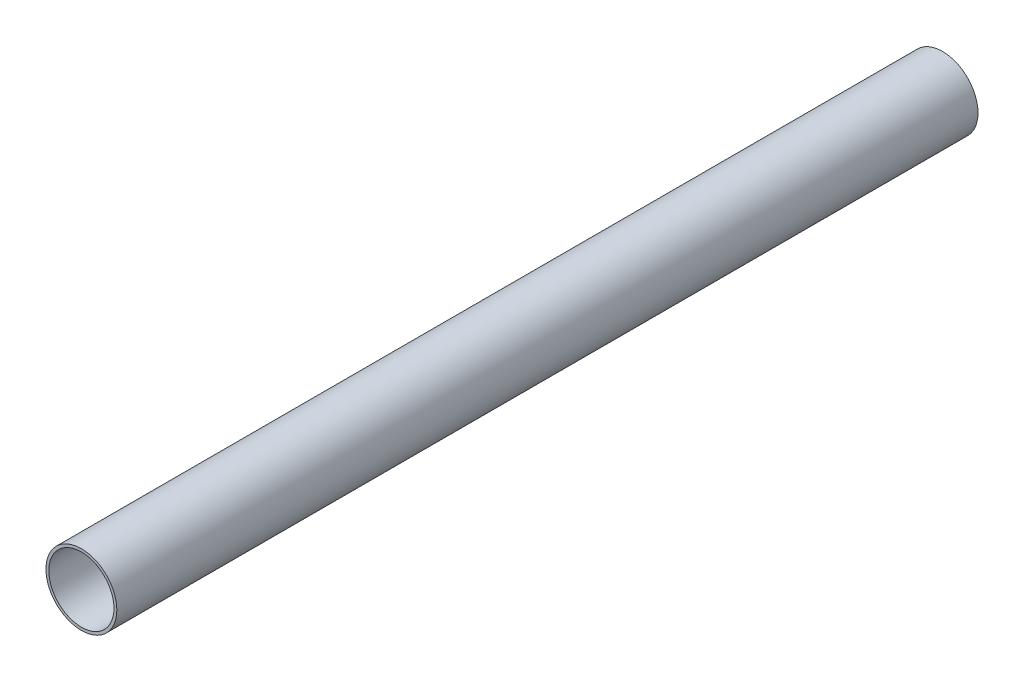
ISO-10303-21;
HEADER;
FILE_DESCRIPTION(('STEP AP214'),'2;1');
FILE_NAME('part.step','',(''),(''),'','','');
FILE_SCHEMA(('AUTOMOTIVE_DESIGN { 1 0 10303 214 1 1 1 1 }'));
ENDSEC;
DATA;
#1=APPLICATION_CONTEXT('core data for automotive mechanical design processes');
#2=APPLICATION_PROTOCOL_DEFINITION('international standard','automotive_design',2000,#1);
#3=PRODUCT_CONTEXT('',#1,'mechanical');
#4=PRODUCT('Part','Part','',(#3));
#5=PRODUCT_RELATED_PRODUCT_CATEGORY('part','',(#4));
#6=PRODUCT_DEFINITION_FORMATION('','',#4);
#7=PRODUCT_DEFINITION_CONTEXT('part definition',#1,'design');
#8=PRODUCT_DEFINITION('design','',#6,#7);
#9=PRODUCT_DEFINITION_SHAPE('','',#8);
#10=(LENGTH_UNIT() NAMED_UNIT(*) SI_UNIT(.MILLI.,.METRE.));
#11=(NAMED_UNIT(*) PLANE_ANGLE_UNIT() SI_UNIT($,.RADIAN.));
#12=(NAMED_UNIT(*) SI_UNIT($,.STERADIAN.) SOLID_ANGLE_UNIT());
#13=UNCERTAINTY_MEASURE_WITH_UNIT(LENGTH_MEASURE(1.E-05),#10,'distance_accuracy_value','');
#14=(GEOMETRIC_REPRESENTATION_CONTEXT(3) GLOBAL_UNCERTAINTY_ASSIGNED_CONTEXT((#13)) GLOBAL_UNIT_ASSIGNED_CONTEXT((#10,
#11,#12)) REPRESENTATION_CONTEXT('',''));
#15=CARTESIAN_POINT('',(0.,0.,0.));
#16=DIRECTION('',(0.,0.,1.));
#17=DIRECTION('',(1.,0.,0.));
#18=AXIS2_PLACEMENT_3D('',#15,#16,#17);
#19=CARTESIAN_POINT('',(0.,0.,300.));
#20=DIRECTION('',(0.,0.,1.));
#21=DIRECTION('',(1.,0.,0.));
#22=AXIS2_PLACEMENT_3D('',#19,#20,#21);
#23=PLANE('',#22);
#24=CARTESIAN_POINT('',(0.,0.,300.));
#25=DIRECTION('',(0.,0.,1.));
#26=DIRECTION('',(1.,0.,0.));
#27=AXIS2_PLACEMENT_3D('',#24,#25,#26);
#28=CIRCLE('',#27,12.35);
#29=CARTESIAN_POINT('',(12.35,0.,300.));
#30=VERTEX_POINT('',#29);
#31=EDGE_CURVE('E10',#30,#30,#28,.T.);
#32=ORIENTED_EDGE('',*,*,#31,.T.);
#33=EDGE_LOOP('',(#32));
#34=FACE_BOUND('',#33,.T.);
#35=CARTESIAN_POINT('',(0.,0.,300.));
#36=DIRECTION('',(0.,0.,1.));
#37=DIRECTION('',(1.,0.,0.));
#38=AXIS2_PLACEMENT_3D('',#35,#36,#37);
#39=CIRCLE('',#38,11.35);
#40=CARTESIAN_POINT('',(11.35,0.,300.));
#41=VERTEX_POINT('',#40);
#42=EDGE_CURVE('E42',#41,#41,#39,.T.);
#43=ORIENTED_EDGE('',*,*,#42,.F.);
#44=EDGE_LOOP('',(#43));
#45=FACE_BOUND('',#44,.T.);
#46=ADVANCED_FACE('F31',(#34,#45),#23,.T.);
#47=CARTESIAN_POINT('',(0.,0.,0.));
#48=DIRECTION('',(0.,0.,1.));
#49=DIRECTION('',(1.,0.,0.));
#50=AXIS2_PLACEMENT_3D('',#47,#48,#49);
#51=PLANE('',#50);
#52=CARTESIAN_POINT('',(0.,0.,0.));
#53=DIRECTION('',(0.,0.,1.));
#54=DIRECTION('',(1.,0.,0.));
#55=AXIS2_PLACEMENT_3D('',#52,#53,#54);
#56=CIRCLE('',#55,12.35);
#57=CARTESIAN_POINT('',(12.35,0.,0.));
#58=VERTEX_POINT('',#57);
#59=EDGE_CURVE('E35',#58,#58,#56,.T.);
#60=ORIENTED_EDGE('',*,*,#59,.F.);
#61=EDGE_LOOP('',(#60));
#62=FACE_BOUND('',#61,.T.);
#63=CARTESIAN_POINT('',(0.,0.,0.));
#64=DIRECTION('',(0.,0.,1.));
#65=DIRECTION('',(1.,0.,0.));
#66=AXIS2_PLACEMENT_3D('',#63,#64,#65);
#67=CIRCLE('',#66,11.35);
#68=CARTESIAN_POINT('',(11.35,0.,0.));
#69=VERTEX_POINT('',#68);
#70=EDGE_CURVE('E44',#69,#69,#67,.T.);
#71=ORIENTED_EDGE('',*,*,#70,.T.);
#72=EDGE_LOOP('',(#71));
#73=FACE_BOUND('',#72,.T.);
#74=ADVANCED_FACE('F54',(#62,#73),#51,.F.);
#75=CARTESIAN_POINT('',(0.,0.,300.));
#76=DIRECTION('',(0.,0.,-1.));
#77=DIRECTION('',(-1.,0.,0.));
#78=AXIS2_PLACEMENT_3D('',#75,#76,#77);
#79=CYLINDRICAL_SURFACE('',#78,12.35);
#80=ORIENTED_EDGE('',*,*,#31,.F.);
#81=EDGE_LOOP('',(#80));
#82=FACE_BOUND('',#81,.T.);
#83=ORIENTED_EDGE('',*,*,#59,.T.);
#84=EDGE_LOOP('',(#83));
#85=FACE_BOUND('',#84,.T.);
#86=ADVANCED_FACE('F33',(#82,#85),#79,.T.);
#87=CARTESIAN_POINT('',(0.,0.,300.));
#88=DIRECTION('',(0.,0.,-1.));
#89=DIRECTION('',(-1.,0.,0.));
#90=AXIS2_PLACEMENT_3D('',#87,#88,#89);
#91=CYLINDRICAL_SURFACE('',#90,11.35);
#92=ORIENTED_EDGE('',*,*,#42,.T.);
#93=EDGE_LOOP('',(#92));
#94=FACE_BOUND('',#93,.T.);
#95=ORIENTED_EDGE('',*,*,#70,.F.);
#96=EDGE_LOOP('',(#95));
#97=FACE_BOUND('',#96,.T.);
#98=ADVANCED_FACE('F50',(#94,#97),#91,.F.);
#99=CLOSED_SHELL('',(#46,#74,#86,#98));
#100=MANIFOLD_SOLID_BREP('B2',#99);
#101=ADVANCED_BREP_SHAPE_REPRESENTATION('',(#18,#100),#14);
#102=SHAPE_DEFINITION_REPRESENTATION(#9,#101);
ENDSEC;
END-ISO-10303-21;
